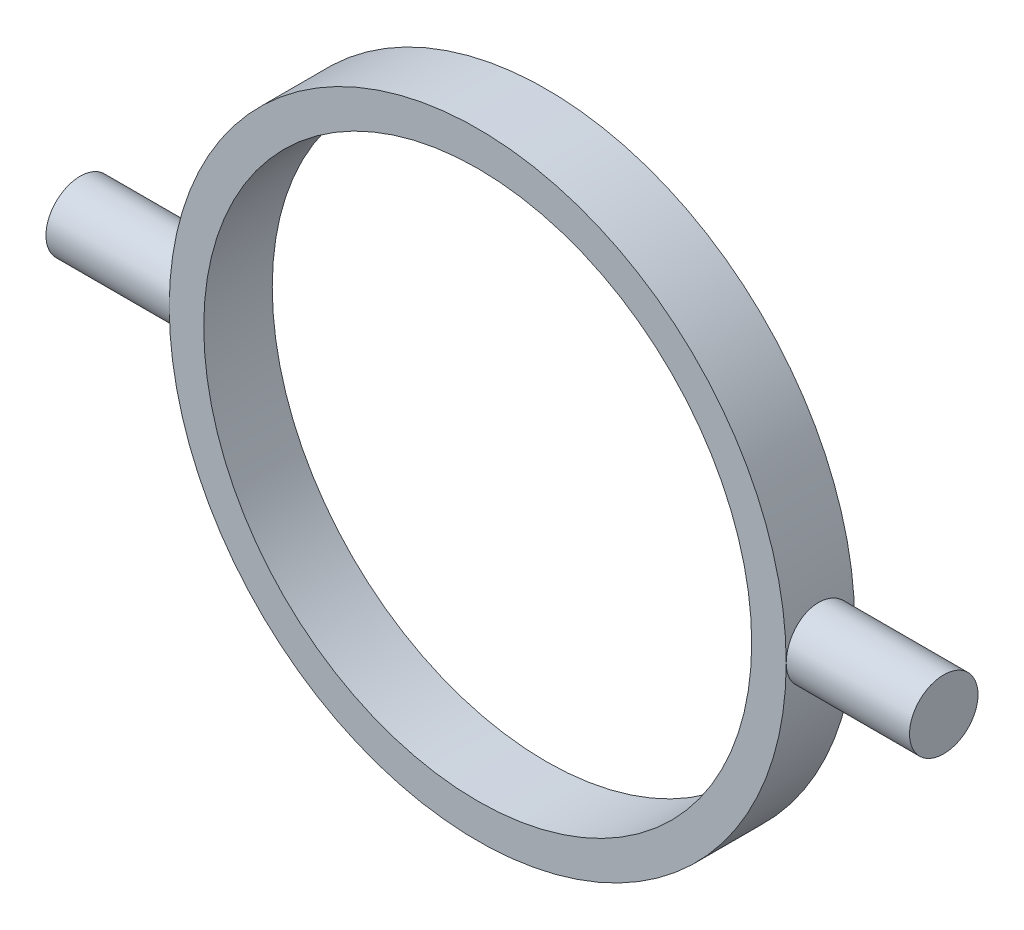
ISO-10303-21;
HEADER;
FILE_DESCRIPTION(('STEP AP214'),'2;1');
FILE_NAME('part.step','',(''),(''),'','','');
FILE_SCHEMA(('AUTOMOTIVE_DESIGN { 1 0 10303 214 1 1 1 1 }'));
ENDSEC;
DATA;
#1=APPLICATION_CONTEXT('core data for automotive mechanical design processes');
#2=APPLICATION_PROTOCOL_DEFINITION('international standard','automotive_design',2000,#1);
#3=PRODUCT_CONTEXT('',#1,'mechanical');
#4=PRODUCT('Part','Part','',(#3));
#5=PRODUCT_RELATED_PRODUCT_CATEGORY('part','',(#4));
#6=PRODUCT_DEFINITION_FORMATION('','',#4);
#7=PRODUCT_DEFINITION_CONTEXT('part definition',#1,'design');
#8=PRODUCT_DEFINITION('design','',#6,#7);
#9=PRODUCT_DEFINITION_SHAPE('','',#8);
#10=(LENGTH_UNIT() NAMED_UNIT(*) SI_UNIT(.MILLI.,.METRE.));
#11=(NAMED_UNIT(*) PLANE_ANGLE_UNIT() SI_UNIT($,.RADIAN.));
#12=(NAMED_UNIT(*) SI_UNIT($,.STERADIAN.) SOLID_ANGLE_UNIT());
#13=UNCERTAINTY_MEASURE_WITH_UNIT(LENGTH_MEASURE(1.E-05),#10,'distance_accuracy_value','');
#14=(GEOMETRIC_REPRESENTATION_CONTEXT(3) GLOBAL_UNCERTAINTY_ASSIGNED_CONTEXT((#13)) GLOBAL_UNIT_ASSIGNED_CONTEXT((#10,
#11,#12)) REPRESENTATION_CONTEXT('',''));
#15=CARTESIAN_POINT('',(0.,0.,0.));
#16=DIRECTION('',(0.,0.,1.));
#17=DIRECTION('',(1.,0.,0.));
#18=AXIS2_PLACEMENT_3D('',#15,#16,#17);
#19=CARTESIAN_POINT('',(0.,0.,3.175));
#20=DIRECTION('',(0.,0.,-1.));
#21=DIRECTION('',(-1.,0.,0.));
#22=AXIS2_PLACEMENT_3D('',#19,#20,#21);
#23=CYLINDRICAL_SURFACE('',#22,14.3);
#24=CARTESIAN_POINT('',(0.,0.,3.175));
#25=DIRECTION('',(0.,0.,1.));
#26=DIRECTION('',(1.,0.,0.));
#27=AXIS2_PLACEMENT_3D('',#24,#25,#26);
#28=CIRCLE('',#27,14.3);
#29=CARTESIAN_POINT('',(-14.3,0.,3.175));
#30=VERTEX_POINT('',#29);
#31=CARTESIAN_POINT('',(14.3,0.,3.175));
#32=VERTEX_POINT('',#31);
#33=EDGE_CURVE('E56',#30,#32,#28,.T.);
#34=ORIENTED_EDGE('',*,*,#33,.F.);
#35=CARTESIAN_POINT('',(-14.3,0.,3.175));
#36=CARTESIAN_POINT('',(-14.2999988781195,-0.0888772005452753,3.17499617952185));
#37=CARTESIAN_POINT('',(-14.2991626347598,-0.177811832280169,3.16751108507889));
#38=CARTESIAN_POINT('',(-14.2959071159944,-0.353211704138334,3.13776670298621));
#39=CARTESIAN_POINT('',(-14.2934861342076,-0.439674177487243,3.11549148957583));
#40=CARTESIAN_POINT('',(-14.2873341974026,-0.607564655430699,3.05682661728114));
#41=CARTESIAN_POINT('',(-14.283604071318,-0.688995807512993,3.020445888309));
#42=CARTESIAN_POINT('',(-14.275250015974,-0.84457949799646,2.93462097815224));
#43=CARTESIAN_POINT('',(-14.2706262543527,-0.918733397617061,2.88517924645707));
#44=CARTESIAN_POINT('',(-14.260979478433,-1.05799987929854,2.77440334800758));
#45=CARTESIAN_POINT('',(-14.2559549737513,-1.12307597629525,2.71302343789332));
#46=CARTESIAN_POINT('',(-14.2460851993755,-1.24202570828179,2.58021144560072));
#47=CARTESIAN_POINT('',(-14.2412399383182,-1.29589880403809,2.50877887983572));
#48=CARTESIAN_POINT('',(-14.2322623083763,-1.39104553274756,2.35765695504027));
#49=CARTESIAN_POINT('',(-14.2281318497102,-1.43228562511002,2.27794635554629));
#50=CARTESIAN_POINT('',(-14.2210705487239,-1.50078152425114,2.112677804042));
#51=CARTESIAN_POINT('',(-14.2181396702621,-1.5280377523488,2.02712002828895));
#52=CARTESIAN_POINT('',(-14.2138232255491,-1.56768282022064,1.85296101230478));
#53=CARTESIAN_POINT('',(-14.2124313176255,-1.58013268908721,1.76437382441847));
#54=CARTESIAN_POINT('',(-14.2113308617599,-1.59000036584148,1.58635726013627));
#55=CARTESIAN_POINT('',(-14.2116222599089,-1.58741865512611,1.49692791080278));
#56=CARTESIAN_POINT('',(-14.2138496931959,-1.56734667222174,1.32018819094783));
#57=CARTESIAN_POINT('',(-14.2157783506056,-1.54992327761291,1.23287011915985));
#58=CARTESIAN_POINT('',(-14.2210514784131,-1.50076669144725,1.06240508711853));
#59=CARTESIAN_POINT('',(-14.2243959719163,-1.46903326636101,0.979258194960446));
#60=CARTESIAN_POINT('',(-14.2321323772166,-1.39208439796647,0.819285939527747));
#61=CARTESIAN_POINT('',(-14.2365265703321,-1.34683953585028,0.742474841923959));
#62=CARTESIAN_POINT('',(-14.2458654090423,-1.24417322738379,0.597510754644362));
#63=CARTESIAN_POINT('',(-14.2508100745021,-1.18675134152796,0.529358077619079));
#64=CARTESIAN_POINT('',(-14.2607255725065,-1.06098864871699,0.403256994268489));
#65=CARTESIAN_POINT('',(-14.2656964010382,-0.992590130504506,0.345366128443119));
#66=CARTESIAN_POINT('',(-14.2750788391693,-0.847015449884542,0.241878800341285));
#67=CARTESIAN_POINT('',(-14.279490447899,-0.76983927382538,0.196282357186413));
#68=CARTESIAN_POINT('',(-14.2872593324194,-0.608858294688055,0.118679528586746));
#69=CARTESIAN_POINT('',(-14.2906163597593,-0.525051935405762,0.0866763449785889));
#70=CARTESIAN_POINT('',(-14.2958954367476,-0.353209591503775,0.0372121050447982));
#71=CARTESIAN_POINT('',(-14.2978175393199,-0.265173763005986,0.0197505123826735));
#72=CARTESIAN_POINT('',(-14.3000033691016,-0.0878694715077502,-6.1225398457936E-05));
#73=CARTESIAN_POINT('',(-14.3002758036586,0.00139002266546319,-0.00249071508608451));
#74=CARTESIAN_POINT('',(-14.2991550166386,0.179044882648662,0.00762190944893942));
#75=CARTESIAN_POINT('',(-14.2977618229007,0.267440262876406,0.0201637734429189));
#76=CARTESIAN_POINT('',(-14.2934718233122,0.440626550654065,0.0597972224009416));
#77=CARTESIAN_POINT('',(-14.290578886574,0.52542612873802,0.0868513740418936));
#78=CARTESIAN_POINT('',(-14.2836136576705,0.689283896923936,0.154702776178906));
#79=CARTESIAN_POINT('',(-14.2795413333271,0.768341930301816,0.195500401652448));
#80=CARTESIAN_POINT('',(-14.2706504897384,0.91882937937023,0.289875441598772));
#81=CARTESIAN_POINT('',(-14.265828974574,0.990226130979229,0.343504654274598));
#82=CARTESIAN_POINT('',(-14.2559896194385,1.12303298588983,0.461946674564903));
#83=CARTESIAN_POINT('',(-14.2509717733708,1.18444277876145,0.526759829686852));
#84=CARTESIAN_POINT('',(-14.2412788178653,1.29581051260931,0.666077522082213));
#85=CARTESIAN_POINT('',(-14.2366053367261,1.34571616049447,0.740623990867027));
#86=CARTESIAN_POINT('',(-14.2281559157934,1.43229875051085,0.897086786427821));
#87=CARTESIAN_POINT('',(-14.2243799613022,1.46897590927412,0.97900299248824));
#88=CARTESIAN_POINT('',(-14.2181637193116,1.52797403255498,1.14770502358406));
#89=CARTESIAN_POINT('',(-14.2157206016113,1.55032543477654,1.23448009534643));
#90=CARTESIAN_POINT('',(-14.2124381669058,1.5801360403656,1.4105803300825));
#91=CARTESIAN_POINT('',(-14.211598792183,1.58759577967466,1.49990540116597));
#92=CARTESIAN_POINT('',(-14.2116202990559,1.58740288138974,1.6780500979183));
#93=CARTESIAN_POINT('',(-14.2124719387924,1.57983238817696,1.76686982497773));
#94=CARTESIAN_POINT('',(-14.2157597443494,1.54996686772631,1.94196687079006));
#95=CARTESIAN_POINT('',(-14.2181959113544,1.52767182948022,2.0282441876422));
#96=CARTESIAN_POINT('',(-14.2243755931118,1.46901404262899,2.19580241956184));
#97=CARTESIAN_POINT('',(-14.2281188231349,1.43265435766607,2.27708441827291));
#98=CARTESIAN_POINT('',(-14.23649140032,1.34690762918117,2.43240577761514));
#99=CARTESIAN_POINT('',(-14.2411207492219,1.29752056008049,2.50644512402527));
#100=CARTESIAN_POINT('',(-14.2507742904415,1.18681376578749,2.64560019061455));
#101=CARTESIAN_POINT('',(-14.2558004277258,1.12543276741702,2.71066703127536));
#102=CARTESIAN_POINT('',(-14.2656636686697,0.992605427151062,2.8296107972892));
#103=CARTESIAN_POINT('',(-14.2705007270793,0.921156694471686,2.88348505720015));
#104=CARTESIAN_POINT('',(-14.2794565511709,0.769978852055174,2.97864829526517));
#105=CARTESIAN_POINT('',(-14.2835730906587,0.690225252496372,3.01989855285304));
#106=CARTESIAN_POINT('',(-14.2906007014627,0.524925833618991,3.08836462434898));
#107=CARTESIAN_POINT('',(-14.293513110935,0.439386567669612,3.11559602578568));
#108=CARTESIAN_POINT('',(-14.2970847326531,0.294483086938573,3.14857290753056));
#109=CARTESIAN_POINT('',(-14.2981727664914,0.236040301387399,3.15846923968329));
#110=CARTESIAN_POINT('',(-14.2996307719715,0.118406839397914,3.17168404096564));
#111=CARTESIAN_POINT('',(-14.3000007474748,0.0592161669831416,3.17500254546802));
#112=CARTESIAN_POINT('',(-14.3,0.,3.175));
#113=B_SPLINE_CURVE_WITH_KNOTS('',3,(#35,#36,#37,#38,#39,#40,#41,#42,#43,#44,#45,#46,#47,#48,
#49,#50,#51,#52,#53,#54,#55,#56,#57,#58,#59,#60,#61,#62,#63,#64,#65,#66,#67,#68,#69,#70,#71,#72,
#73,#74,#75,#76,#77,#78,#79,#80,#81,#82,#83,#84,#85,#86,#87,#88,#89,#90,#91,#92,#93,#94,#95,#96,
#97,#98,#99,#100,#101,#102,#103,#104,#105,#106,#107,#108,#109,#110,#111,#112),.UNSPECIFIED.,.T.,
.F.,(4,2,2,2,2,2,2,2,2,2,2,2,2,2,2,2,2,2,2,2,2,2,2,2,2,2,2,2,2,2,2,2,2,2,2,2,2,2,4),(0.,
0.26641534101815,0.533118020001767,0.799652129967431,1.06613628897766,1.33366239662592,
1.60120137811691,1.86944463855952,2.13767981664221,2.40480550381181,2.67192263613988,
2.93784245027725,3.20376660419157,3.47027403651821,3.73679108953947,4.0047582968698,
4.27272592096878,4.54075662878877,4.80877745041286,5.07538235132841,5.34198279631716,
5.60789884978078,5.87382215909619,6.14083761034639,6.4078613597954,6.67607595266725,
6.94428615301044,7.21192458566179,7.47955338600084,7.74572354706047,8.0118939071118,
8.27800632102425,8.54411925744105,8.81162900618069,9.07920238782935,9.34758843466676,
9.61567541571735,9.79318078336629,9.9706851964645),.UNSPECIFIED.);
#114=CARTESIAN_POINT('',(-14.3,0.,0.));
#115=VERTEX_POINT('',#114);
#116=EDGE_CURVE('E11',#30,#115,#113,.T.);
#117=ORIENTED_EDGE('',*,*,#116,.T.);
#118=CARTESIAN_POINT('',(0.,0.,0.));
#119=DIRECTION('',(0.,0.,1.));
#120=DIRECTION('',(1.,0.,0.));
#121=AXIS2_PLACEMENT_3D('',#118,#119,#120);
#122=CIRCLE('',#121,14.3);
#123=CARTESIAN_POINT('',(14.3,0.,0.));
#124=VERTEX_POINT('',#123);
#125=EDGE_CURVE('E70',#115,#124,#122,.T.);
#126=ORIENTED_EDGE('',*,*,#125,.T.);
#127=CARTESIAN_POINT('',(14.3,0.,3.175));
#128=CARTESIAN_POINT('',(14.2999988781195,0.0888772005452753,3.17499617952185));
#129=CARTESIAN_POINT('',(14.2991626347598,0.177811832280169,3.16751108507889));
#130=CARTESIAN_POINT('',(14.2959071159944,0.353211704138334,3.13776670298621));
#131=CARTESIAN_POINT('',(14.2934861342076,0.439674177487243,3.11549148957583));
#132=CARTESIAN_POINT('',(14.2873341974026,0.607564655430699,3.05682661728114));
#133=CARTESIAN_POINT('',(14.283604071318,0.688995807512993,3.020445888309));
#134=CARTESIAN_POINT('',(14.275250015974,0.84457949799646,2.93462097815224));
#135=CARTESIAN_POINT('',(14.2706262543527,0.918733397617061,2.88517924645707));
#136=CARTESIAN_POINT('',(14.260979478433,1.05799987929854,2.77440334800758));
#137=CARTESIAN_POINT('',(14.2559549737513,1.12307597629525,2.71302343789332));
#138=CARTESIAN_POINT('',(14.2460851993755,1.24202570828179,2.58021144560072));
#139=CARTESIAN_POINT('',(14.2412399383182,1.29589880403809,2.50877887983572));
#140=CARTESIAN_POINT('',(14.2322623083763,1.39104553274756,2.35765695504027));
#141=CARTESIAN_POINT('',(14.2281318497102,1.43228562511002,2.27794635554629));
#142=CARTESIAN_POINT('',(14.2210705487239,1.50078152425114,2.112677804042));
#143=CARTESIAN_POINT('',(14.2181396702621,1.5280377523488,2.02712002828895));
#144=CARTESIAN_POINT('',(14.2138232255491,1.56768282022064,1.85296101230478));
#145=CARTESIAN_POINT('',(14.2124313176255,1.58013268908721,1.76437382441847));
#146=CARTESIAN_POINT('',(14.2113308617599,1.59000036584148,1.58635726013627));
#147=CARTESIAN_POINT('',(14.2116222599089,1.58741865512611,1.49692791080278));
#148=CARTESIAN_POINT('',(14.2138496931959,1.56734667222174,1.32018819094783));
#149=CARTESIAN_POINT('',(14.2157783506056,1.54992327761291,1.23287011915985));
#150=CARTESIAN_POINT('',(14.2210514784131,1.50076669144725,1.06240508711853));
#151=CARTESIAN_POINT('',(14.2243959719163,1.46903326636101,0.979258194960446));
#152=CARTESIAN_POINT('',(14.2321323772166,1.39208439796647,0.819285939527747));
#153=CARTESIAN_POINT('',(14.2365265703321,1.34683953585028,0.742474841923959));
#154=CARTESIAN_POINT('',(14.2458654090423,1.24417322738379,0.597510754644362));
#155=CARTESIAN_POINT('',(14.2508100745021,1.18675134152796,0.529358077619079));
#156=CARTESIAN_POINT('',(14.2607255725065,1.06098864871699,0.403256994268489));
#157=CARTESIAN_POINT('',(14.2656964010382,0.992590130504506,0.345366128443119));
#158=CARTESIAN_POINT('',(14.2750788391693,0.847015449884542,0.241878800341285));
#159=CARTESIAN_POINT('',(14.279490447899,0.76983927382538,0.196282357186413));
#160=CARTESIAN_POINT('',(14.2872593324194,0.608858294688055,0.118679528586746));
#161=CARTESIAN_POINT('',(14.2906163597593,0.525051935405762,0.0866763449785889));
#162=CARTESIAN_POINT('',(14.2958954367476,0.353209591503775,0.0372121050447982));
#163=CARTESIAN_POINT('',(14.2978175393199,0.265173763005986,0.0197505123826735));
#164=CARTESIAN_POINT('',(14.3000033691016,0.0878694715077502,-6.1225398457936E-05));
#165=CARTESIAN_POINT('',(14.3002758036586,-0.00139002266546319,-0.00249071508608451));
#166=CARTESIAN_POINT('',(14.2991550166386,-0.179044882648662,0.00762190944893942));
#167=CARTESIAN_POINT('',(14.2977618229007,-0.267440262876406,0.0201637734429189));
#168=CARTESIAN_POINT('',(14.2934718233122,-0.440626550654065,0.0597972224009416));
#169=CARTESIAN_POINT('',(14.290578886574,-0.52542612873802,0.0868513740418936));
#170=CARTESIAN_POINT('',(14.2836136576705,-0.689283896923936,0.154702776178906));
#171=CARTESIAN_POINT('',(14.2795413333271,-0.768341930301816,0.195500401652448));
#172=CARTESIAN_POINT('',(14.2706504897384,-0.91882937937023,0.289875441598772));
#173=CARTESIAN_POINT('',(14.265828974574,-0.990226130979229,0.343504654274598));
#174=CARTESIAN_POINT('',(14.2559896194385,-1.12303298588983,0.461946674564903));
#175=CARTESIAN_POINT('',(14.2509717733708,-1.18444277876145,0.526759829686852));
#176=CARTESIAN_POINT('',(14.2412788178653,-1.29581051260931,0.666077522082213));
#177=CARTESIAN_POINT('',(14.2366053367261,-1.34571616049447,0.740623990867027));
#178=CARTESIAN_POINT('',(14.2281559157934,-1.43229875051085,0.897086786427821));
#179=CARTESIAN_POINT('',(14.2243799613022,-1.46897590927412,0.97900299248824));
#180=CARTESIAN_POINT('',(14.2181637193116,-1.52797403255498,1.14770502358406));
#181=CARTESIAN_POINT('',(14.2157206016113,-1.55032543477654,1.23448009534643));
#182=CARTESIAN_POINT('',(14.2124381669058,-1.5801360403656,1.4105803300825));
#183=CARTESIAN_POINT('',(14.211598792183,-1.58759577967466,1.49990540116597));
#184=CARTESIAN_POINT('',(14.2116202990559,-1.58740288138974,1.6780500979183));
#185=CARTESIAN_POINT('',(14.2124719387924,-1.57983238817696,1.76686982497773));
#186=CARTESIAN_POINT('',(14.2157597443494,-1.54996686772631,1.94196687079006));
#187=CARTESIAN_POINT('',(14.2181959113544,-1.52767182948022,2.0282441876422));
#188=CARTESIAN_POINT('',(14.2243755931118,-1.46901404262899,2.19580241956184));
#189=CARTESIAN_POINT('',(14.2281188231349,-1.43265435766607,2.27708441827291));
#190=CARTESIAN_POINT('',(14.23649140032,-1.34690762918117,2.43240577761514));
#191=CARTESIAN_POINT('',(14.2411207492219,-1.29752056008049,2.50644512402527));
#192=CARTESIAN_POINT('',(14.2507742904415,-1.18681376578749,2.64560019061455));
#193=CARTESIAN_POINT('',(14.2558004277258,-1.12543276741702,2.71066703127536));
#194=CARTESIAN_POINT('',(14.2656636686697,-0.992605427151062,2.8296107972892));
#195=CARTESIAN_POINT('',(14.2705007270793,-0.921156694471686,2.88348505720015));
#196=CARTESIAN_POINT('',(14.2794565511709,-0.769978852055174,2.97864829526517));
#197=CARTESIAN_POINT('',(14.2835730906587,-0.690225252496372,3.01989855285304));
#198=CARTESIAN_POINT('',(14.2906007014627,-0.524925833618991,3.08836462434898));
#199=CARTESIAN_POINT('',(14.293513110935,-0.439386567669612,3.11559602578568));
#200=CARTESIAN_POINT('',(14.2970847326531,-0.294483086938573,3.14857290753056));
#201=CARTESIAN_POINT('',(14.2981727664914,-0.236040301387399,3.15846923968329));
#202=CARTESIAN_POINT('',(14.2996307719715,-0.118406839397914,3.17168404096564));
#203=CARTESIAN_POINT('',(14.3000007474748,-0.0592161669831416,3.17500254546802));
#204=CARTESIAN_POINT('',(14.3,0.,3.175));
#205=B_SPLINE_CURVE_WITH_KNOTS('',3,(#127,#128,#129,#130,#131,#132,#133,#134,#135,#136,#137,
#138,#139,#140,#141,#142,#143,#144,#145,#146,#147,#148,#149,#150,#151,#152,#153,#154,#155,#156,
#157,#158,#159,#160,#161,#162,#163,#164,#165,#166,#167,#168,#169,#170,#171,#172,#173,#174,#175,
#176,#177,#178,#179,#180,#181,#182,#183,#184,#185,#186,#187,#188,#189,#190,#191,#192,#193,#194,
#195,#196,#197,#198,#199,#200,#201,#202,#203,#204),.UNSPECIFIED.,.T.,.F.,(4,2,2,2,2,2,2,2,2,2,2,
2,2,2,2,2,2,2,2,2,2,2,2,2,2,2,2,2,2,2,2,2,2,2,2,2,2,2,4),(0.,0.26641534101815,0.533118020001767,
0.799652129967431,1.06613628897766,1.33366239662592,1.60120137811691,1.86944463855952,
2.13767981664221,2.40480550381181,2.67192263613988,2.93784245027725,3.20376660419157,
3.47027403651821,3.73679108953947,4.0047582968698,4.27272592096878,4.54075662878877,
4.80877745041286,5.07538235132841,5.34198279631716,5.60789884978078,5.87382215909619,
6.14083761034639,6.4078613597954,6.67607595266725,6.94428615301044,7.21192458566179,
7.47955338600084,7.74572354706047,8.0118939071118,8.27800632102425,8.54411925744105,
8.81162900618069,9.07920238782935,9.34758843466676,9.61567541571735,9.79318078336629,
9.9706851964645),.UNSPECIFIED.);
#206=EDGE_CURVE('E83',#124,#32,#205,.T.);
#207=ORIENTED_EDGE('',*,*,#206,.T.);
#208=EDGE_LOOP('',(#34,#117,#126,#207));
#209=FACE_BOUND('',#208,.T.);
#210=ADVANCED_FACE('F33',(#209),#23,.T.);
#211=CARTESIAN_POINT('',(0.,0.,3.175));
#212=DIRECTION('',(0.,0.,1.));
#213=DIRECTION('',(1.,0.,0.));
#214=AXIS2_PLACEMENT_3D('',#211,#212,#213);
#215=PLANE('',#214);
#216=EDGE_CURVE('E80',#32,#30,#28,.T.);
#217=ORIENTED_EDGE('',*,*,#216,.T.);
#218=ORIENTED_EDGE('',*,*,#33,.T.);
#219=EDGE_LOOP('',(#217,#218));
#220=FACE_BOUND('',#219,.T.);
#221=CARTESIAN_POINT('',(0.,0.,3.175));
#222=DIRECTION('',(0.,0.,1.));
#223=DIRECTION('',(1.,0.,0.));
#224=AXIS2_PLACEMENT_3D('',#221,#222,#223);
#225=CIRCLE('',#224,12.7);
#226=CARTESIAN_POINT('',(12.7,0.,3.175));
#227=VERTEX_POINT('',#226);
#228=EDGE_CURVE('E77',#227,#227,#225,.T.);
#229=ORIENTED_EDGE('',*,*,#228,.F.);
#230=EDGE_LOOP('',(#229));
#231=FACE_BOUND('',#230,.T.);
#232=ADVANCED_FACE('F98',(#220,#231),#215,.T.);
#233=CARTESIAN_POINT('',(0.,0.,0.));
#234=DIRECTION('',(0.,0.,1.));
#235=DIRECTION('',(1.,0.,0.));
#236=AXIS2_PLACEMENT_3D('',#233,#234,#235);
#237=PLANE('',#236);
#238=ORIENTED_EDGE('',*,*,#125,.F.);
#239=EDGE_CURVE('E76',#124,#115,#122,.T.);
#240=ORIENTED_EDGE('',*,*,#239,.F.);
#241=EDGE_LOOP('',(#238,#240));
#242=FACE_BOUND('',#241,.T.);
#243=CARTESIAN_POINT('',(0.,0.,0.));
#244=DIRECTION('',(0.,0.,1.));
#245=DIRECTION('',(1.,0.,0.));
#246=AXIS2_PLACEMENT_3D('',#243,#244,#245);
#247=CIRCLE('',#246,12.7);
#248=CARTESIAN_POINT('',(12.7,0.,0.));
#249=VERTEX_POINT('',#248);
#250=EDGE_CURVE('E153',#249,#249,#247,.T.);
#251=ORIENTED_EDGE('',*,*,#250,.T.);
#252=EDGE_LOOP('',(#251));
#253=FACE_BOUND('',#252,.T.);
#254=ADVANCED_FACE('F74',(#242,#253),#237,.F.);
#255=ORIENTED_EDGE('',*,*,#239,.T.);
#256=EDGE_CURVE('E38',#115,#30,#113,.T.);
#257=ORIENTED_EDGE('',*,*,#256,.T.);
#258=ORIENTED_EDGE('',*,*,#216,.F.);
#259=EDGE_CURVE('E66',#32,#124,#205,.T.);
#260=ORIENTED_EDGE('',*,*,#259,.T.);
#261=EDGE_LOOP('',(#255,#257,#258,#260));
#262=FACE_BOUND('',#261,.T.);
#263=ADVANCED_FACE('F35',(#262),#23,.T.);
#264=CARTESIAN_POINT('',(0.,0.,3.175));
#265=DIRECTION('',(0.,0.,-1.));
#266=DIRECTION('',(-1.,0.,0.));
#267=AXIS2_PLACEMENT_3D('',#264,#265,#266);
#268=CYLINDRICAL_SURFACE('',#267,12.7);
#269=ORIENTED_EDGE('',*,*,#228,.T.);
#270=EDGE_LOOP('',(#269));
#271=FACE_BOUND('',#270,.T.);
#272=ORIENTED_EDGE('',*,*,#250,.F.);
#273=EDGE_LOOP('',(#272));
#274=FACE_BOUND('',#273,.T.);
#275=ADVANCED_FACE('F93',(#271,#274),#268,.F.);
#276=CARTESIAN_POINT('',(13.665,0.,1.5875));
#277=DIRECTION('',(1.,0.,0.));
#278=DIRECTION('',(0.,0.,-1.));
#279=AXIS2_PLACEMENT_3D('',#276,#277,#278);
#280=CYLINDRICAL_SURFACE('',#279,1.5875);
#281=CARTESIAN_POINT('',(20.015,0.,1.5875));
#282=DIRECTION('',(1.,0.,0.));
#283=DIRECTION('',(0.,0.,-1.));
#284=AXIS2_PLACEMENT_3D('',#281,#282,#283);
#285=CIRCLE('',#284,1.5875);
#286=CARTESIAN_POINT('',(20.015,0.,0.));
#287=VERTEX_POINT('',#286);
#288=EDGE_CURVE('E150',#287,#287,#285,.T.);
#289=ORIENTED_EDGE('',*,*,#288,.F.);
#290=EDGE_LOOP('',(#289));
#291=FACE_BOUND('',#290,.T.);
#292=ORIENTED_EDGE('',*,*,#259,.F.);
#293=ORIENTED_EDGE('',*,*,#206,.F.);
#294=EDGE_LOOP('',(#292,#293));
#295=FACE_BOUND('',#294,.T.);
#296=ADVANCED_FACE('F87',(#291,#295),#280,.T.);
#297=CARTESIAN_POINT('',(20.015,0.,1.5875));
#298=DIRECTION('',(1.,0.,0.));
#299=DIRECTION('',(0.,0.,-1.));
#300=AXIS2_PLACEMENT_3D('',#297,#298,#299);
#301=PLANE('',#300);
#302=ORIENTED_EDGE('',*,*,#288,.T.);
#303=EDGE_LOOP('',(#302));
#304=FACE_BOUND('',#303,.T.);
#305=ADVANCED_FACE('F92',(#304),#301,.T.);
#306=CARTESIAN_POINT('',(-13.665,0.,1.5875));
#307=DIRECTION('',(-1.,0.,0.));
#308=DIRECTION('',(0.,0.,1.));
#309=AXIS2_PLACEMENT_3D('',#306,#307,#308);
#310=CYLINDRICAL_SURFACE('',#309,1.5875);
#311=CARTESIAN_POINT('',(-20.015,0.,1.5875));
#312=DIRECTION('',(-1.,0.,0.));
#313=DIRECTION('',(0.,0.,-1.));
#314=AXIS2_PLACEMENT_3D('',#311,#312,#313);
#315=CIRCLE('',#314,1.5875);
#316=CARTESIAN_POINT('',(-20.015,0.,0.));
#317=VERTEX_POINT('',#316);
#318=EDGE_CURVE('E149',#317,#317,#315,.T.);
#319=ORIENTED_EDGE('',*,*,#318,.F.);
#320=EDGE_LOOP('',(#319));
#321=FACE_BOUND('',#320,.T.);
#322=ORIENTED_EDGE('',*,*,#116,.F.);
#323=ORIENTED_EDGE('',*,*,#256,.F.);
#324=EDGE_LOOP('',(#322,#323));
#325=FACE_BOUND('',#324,.T.);
#326=ADVANCED_FACE('F62',(#321,#325),#310,.T.);
#327=CARTESIAN_POINT('',(-20.015,0.,1.5875));
#328=DIRECTION('',(-1.,0.,0.));
#329=DIRECTION('',(0.,0.,-1.));
#330=AXIS2_PLACEMENT_3D('',#327,#328,#329);
#331=PLANE('',#330);
#332=ORIENTED_EDGE('',*,*,#318,.T.);
#333=EDGE_LOOP('',(#332));
#334=FACE_BOUND('',#333,.T.);
#335=ADVANCED_FACE('F132',(#334),#331,.T.);
#336=CLOSED_SHELL('',(#210,#232,#254,#263,#275,#296,#305,#326,#335));
#337=MANIFOLD_SOLID_BREP('B2',#336);
#338=ADVANCED_BREP_SHAPE_REPRESENTATION('',(#18,#337),#14);
#339=SHAPE_DEFINITION_REPRESENTATION(#9,#338);
ENDSEC;
END-ISO-10303-21;
